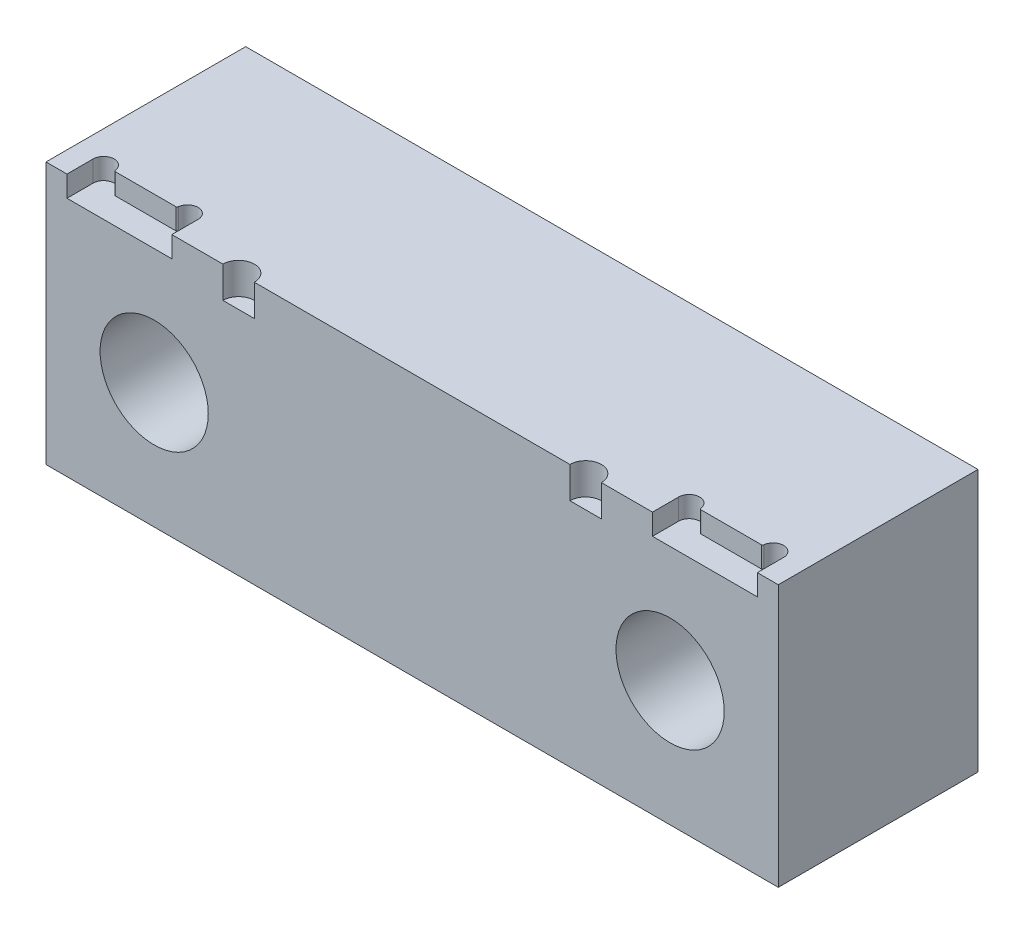
ISO-10303-21;
HEADER;
FILE_DESCRIPTION(('STEP AP214'),'2;1');
FILE_NAME('part.step','',(''),(''),'','','');
FILE_SCHEMA(('AUTOMOTIVE_DESIGN { 1 0 10303 214 1 1 1 1 }'));
ENDSEC;
DATA;
#1=APPLICATION_CONTEXT('core data for automotive mechanical design processes');
#2=APPLICATION_PROTOCOL_DEFINITION('international standard','automotive_design',2000,#1);
#3=PRODUCT_CONTEXT('',#1,'mechanical');
#4=PRODUCT('Part','Part','',(#3));
#5=PRODUCT_RELATED_PRODUCT_CATEGORY('part','',(#4));
#6=PRODUCT_DEFINITION_FORMATION('','',#4);
#7=PRODUCT_DEFINITION_CONTEXT('part definition',#1,'design');
#8=PRODUCT_DEFINITION('design','',#6,#7);
#9=PRODUCT_DEFINITION_SHAPE('','',#8);
#10=(LENGTH_UNIT() NAMED_UNIT(*) SI_UNIT(.MILLI.,.METRE.));
#11=(NAMED_UNIT(*) PLANE_ANGLE_UNIT() SI_UNIT($,.RADIAN.));
#12=(NAMED_UNIT(*) SI_UNIT($,.STERADIAN.) SOLID_ANGLE_UNIT());
#13=UNCERTAINTY_MEASURE_WITH_UNIT(LENGTH_MEASURE(1.E-05),#10,'distance_accuracy_value','');
#14=(GEOMETRIC_REPRESENTATION_CONTEXT(3) GLOBAL_UNCERTAINTY_ASSIGNED_CONTEXT((#13)) GLOBAL_UNIT_ASSIGNED_CONTEXT((#10,
#11,#12)) REPRESENTATION_CONTEXT('',''));
#15=CARTESIAN_POINT('',(0.,0.,0.));
#16=DIRECTION('',(0.,0.,1.));
#17=DIRECTION('',(1.,0.,0.));
#18=AXIS2_PLACEMENT_3D('',#15,#16,#17);
#19=CARTESIAN_POINT('',(69.85,-25.,-19.05));
#20=DIRECTION('',(0.,0.,1.));
#21=DIRECTION('',(1.,0.,0.));
#22=AXIS2_PLACEMENT_3D('',#19,#20,#21);
#23=PLANE('',#22);
#24=CARTESIAN_POINT('',(-49.2125,-1.124,-19.05));
#25=DIRECTION('',(0.,0.,1.));
#26=DIRECTION('',(1.,0.,0.));
#27=AXIS2_PLACEMENT_3D('',#24,#25,#26);
#28=CIRCLE('',#27,6.94562999999999);
#29=CARTESIAN_POINT('',(-42.26687,-1.124,-19.05));
#30=VERTEX_POINT('',#29);
#31=EDGE_CURVE('E332',#30,#30,#28,.T.);
#32=ORIENTED_EDGE('',*,*,#31,.T.);
#33=EDGE_LOOP('',(#32));
#34=FACE_BOUND('',#33,.T.);
#35=CARTESIAN_POINT('',(49.2125,-1.124,-19.05));
#36=DIRECTION('',(0.,0.,1.));
#37=DIRECTION('',(1.,0.,0.));
#38=AXIS2_PLACEMENT_3D('',#35,#36,#37);
#39=CIRCLE('',#38,6.94562999999999);
#40=CARTESIAN_POINT('',(56.15813,-1.124,-19.05));
#41=VERTEX_POINT('',#40);
#42=EDGE_CURVE('E344',#41,#41,#39,.T.);
#43=ORIENTED_EDGE('',*,*,#42,.T.);
#44=EDGE_LOOP('',(#43));
#45=FACE_BOUND('',#44,.T.);
#46=DIRECTION('',(0.,1.,0.));
#47=VECTOR('',#46,1.);
#48=CARTESIAN_POINT('',(-69.85,-25.,-19.05));
#49=LINE('',#48,#47);
#50=CARTESIAN_POINT('',(-69.85,-25.,-19.05));
#51=VERTEX_POINT('',#50);
#52=CARTESIAN_POINT('',(-69.85,25.,-19.05));
#53=VERTEX_POINT('',#52);
#54=EDGE_CURVE('E347',#51,#53,#49,.T.);
#55=ORIENTED_EDGE('',*,*,#54,.T.);
#56=DIRECTION('',(-1.,0.,0.));
#57=VECTOR('',#56,1.);
#58=CARTESIAN_POINT('',(69.85,25.,-19.05));
#59=LINE('',#58,#57);
#60=CARTESIAN_POINT('',(69.85,25.,-19.05));
#61=VERTEX_POINT('',#60);
#62=EDGE_CURVE('E374',#61,#53,#59,.T.);
#63=ORIENTED_EDGE('',*,*,#62,.F.);
#64=DIRECTION('',(0.,1.,0.));
#65=VECTOR('',#64,1.);
#66=CARTESIAN_POINT('',(69.85,-25.,-19.05));
#67=LINE('',#66,#65);
#68=CARTESIAN_POINT('',(69.85,-25.,-19.05));
#69=VERTEX_POINT('',#68);
#70=EDGE_CURVE('E348',#69,#61,#67,.T.);
#71=ORIENTED_EDGE('',*,*,#70,.F.);
#72=DIRECTION('',(-1.,0.,0.));
#73=VECTOR('',#72,1.);
#74=CARTESIAN_POINT('',(69.85,-25.,-19.05));
#75=LINE('',#74,#73);
#76=EDGE_CURVE('E358',#69,#51,#75,.T.);
#77=ORIENTED_EDGE('',*,*,#76,.T.);
#78=EDGE_LOOP('',(#55,#63,#71,#77));
#79=FACE_BOUND('',#78,.T.);
#80=ADVANCED_FACE('F37',(#34,#45,#79),#23,.F.);
#81=CARTESIAN_POINT('',(69.85,25.,19.05));
#82=DIRECTION('',(0.,-1.,0.));
#83=DIRECTION('',(0.,0.,-1.));
#84=AXIS2_PLACEMENT_3D('',#81,#82,#83);
#85=PLANE('',#84);
#86=CARTESIAN_POINT('',(-63.85,25.,14.05));
#87=DIRECTION('',(0.,-1.,0.));
#88=DIRECTION('',(0.,0.,-1.));
#89=AXIS2_PLACEMENT_3D('',#86,#87,#88);
#90=CIRCLE('',#89,2.);
#91=CARTESIAN_POINT('',(-65.85,25.,14.05));
#92=VERTEX_POINT('',#91);
#93=CARTESIAN_POINT('',(-61.8627392824604,25.,13.8246228926353));
#94=VERTEX_POINT('',#93);
#95=EDGE_CURVE('E215',#92,#94,#90,.T.);
#96=ORIENTED_EDGE('',*,*,#95,.T.);
#97=CARTESIAN_POINT('',(-61.6103571713329,25.,13.796));
#98=DIRECTION('',(0.,-1.,0.));
#99=DIRECTION('',(0.,0.,-1.));
#100=AXIS2_PLACEMENT_3D('',#97,#98,#99);
#101=CIRCLE('',#100,0.254);
#102=CARTESIAN_POINT('',(-61.6103571713329,25.,14.05));
#103=VERTEX_POINT('',#102);
#104=EDGE_CURVE('E386',#94,#103,#101,.F.);
#105=ORIENTED_EDGE('',*,*,#104,.T.);
#106=DIRECTION('',(1.,0.,0.));
#107=VECTOR('',#106,1.);
#108=CARTESIAN_POINT('',(-61.85,25.,14.05));
#109=LINE('',#108,#107);
#110=CARTESIAN_POINT('',(-50.0896428286671,25.,14.05));
#111=VERTEX_POINT('',#110);
#112=EDGE_CURVE('E221',#103,#111,#109,.T.);
#113=ORIENTED_EDGE('',*,*,#112,.T.);
#114=CARTESIAN_POINT('',(-50.0896428286671,25.,13.796));
#115=DIRECTION('',(0.,-1.,0.));
#116=DIRECTION('',(0.,0.,-1.));
#117=AXIS2_PLACEMENT_3D('',#114,#115,#116);
#118=CIRCLE('',#117,0.254);
#119=CARTESIAN_POINT('',(-49.8372607175396,25.,13.8246228926353));
#120=VERTEX_POINT('',#119);
#121=EDGE_CURVE('E384',#111,#120,#118,.F.);
#122=ORIENTED_EDGE('',*,*,#121,.T.);
#123=CARTESIAN_POINT('',(-47.85,25.,14.05));
#124=DIRECTION('',(0.,1.,0.));
#125=DIRECTION('',(0.,0.,1.));
#126=AXIS2_PLACEMENT_3D('',#123,#124,#125);
#127=CIRCLE('',#126,2.00000000000001);
#128=CARTESIAN_POINT('',(-45.85,25.,14.05));
#129=VERTEX_POINT('',#128);
#130=EDGE_CURVE('E231',#129,#120,#127,.T.);
#131=ORIENTED_EDGE('',*,*,#130,.F.);
#132=DIRECTION('',(0.,0.,-1.));
#133=VECTOR('',#132,1.);
#134=CARTESIAN_POINT('',(-45.85,25.,19.05));
#135=LINE('',#134,#133);
#136=CARTESIAN_POINT('',(-45.85,25.,19.05));
#137=VERTEX_POINT('',#136);
#138=EDGE_CURVE('E227',#137,#129,#135,.T.);
#139=ORIENTED_EDGE('',*,*,#138,.F.);
#140=DIRECTION('',(-1.,0.,0.));
#141=VECTOR('',#140,1.);
#142=CARTESIAN_POINT('',(69.85,25.,19.05));
#143=LINE('',#142,#141);
#144=CARTESIAN_POINT('',(-36.1,25.,19.05));
#145=VERTEX_POINT('',#144);
#146=EDGE_CURVE('E376',#145,#137,#143,.T.);
#147=ORIENTED_EDGE('',*,*,#146,.F.);
#148=CARTESIAN_POINT('',(-33.1,25.,19.05));
#149=DIRECTION('',(0.,1.,0.));
#150=DIRECTION('',(0.,0.,-1.));
#151=AXIS2_PLACEMENT_3D('',#148,#149,#150);
#152=CIRCLE('',#151,3.);
#153=CARTESIAN_POINT('',(-30.1,25.,19.05));
#154=VERTEX_POINT('',#153);
#155=EDGE_CURVE('E307',#154,#145,#152,.T.);
#156=ORIENTED_EDGE('',*,*,#155,.F.);
#157=CARTESIAN_POINT('',(30.1,25.,19.05));
#158=VERTEX_POINT('',#157);
#159=EDGE_CURVE('E764',#158,#154,#143,.T.);
#160=ORIENTED_EDGE('',*,*,#159,.F.);
#161=CARTESIAN_POINT('',(33.1,25.,19.05));
#162=DIRECTION('',(0.,1.,0.));
#163=DIRECTION('',(0.,0.,1.));
#164=AXIS2_PLACEMENT_3D('',#161,#162,#163);
#165=CIRCLE('',#164,3.);
#166=CARTESIAN_POINT('',(36.1,25.,19.05));
#167=VERTEX_POINT('',#166);
#168=EDGE_CURVE('E289',#167,#158,#165,.T.);
#169=ORIENTED_EDGE('',*,*,#168,.F.);
#170=CARTESIAN_POINT('',(45.85,25.,19.05));
#171=VERTEX_POINT('',#170);
#172=EDGE_CURVE('E375',#171,#167,#143,.T.);
#173=ORIENTED_EDGE('',*,*,#172,.F.);
#174=DIRECTION('',(0.,0.,-1.));
#175=VECTOR('',#174,1.);
#176=CARTESIAN_POINT('',(45.85,25.,0.));
#177=LINE('',#176,#175);
#178=CARTESIAN_POINT('',(45.85,25.,14.05));
#179=VERTEX_POINT('',#178);
#180=EDGE_CURVE('E261',#171,#179,#177,.T.);
#181=ORIENTED_EDGE('',*,*,#180,.T.);
#182=CARTESIAN_POINT('',(47.85,25.,14.05));
#183=DIRECTION('',(0.,1.,0.));
#184=DIRECTION('',(0.,0.,1.));
#185=AXIS2_PLACEMENT_3D('',#182,#183,#184);
#186=CIRCLE('',#185,2.00000000000001);
#187=CARTESIAN_POINT('',(49.8372607175396,25.,13.8246228926353));
#188=VERTEX_POINT('',#187);
#189=EDGE_CURVE('E282',#179,#188,#186,.F.);
#190=ORIENTED_EDGE('',*,*,#189,.T.);
#191=CARTESIAN_POINT('',(50.0896428286671,25.,13.796));
#192=DIRECTION('',(0.,-1.,0.));
#193=DIRECTION('',(0.,0.,-1.));
#194=AXIS2_PLACEMENT_3D('',#191,#192,#193);
#195=CIRCLE('',#194,0.254);
#196=CARTESIAN_POINT('',(50.0896428286671,25.,14.05));
#197=VERTEX_POINT('',#196);
#198=EDGE_CURVE('E382',#188,#197,#195,.F.);
#199=ORIENTED_EDGE('',*,*,#198,.T.);
#200=DIRECTION('',(-1.,0.,0.));
#201=VECTOR('',#200,1.);
#202=CARTESIAN_POINT('',(0.,25.,14.05));
#203=LINE('',#202,#201);
#204=CARTESIAN_POINT('',(61.6103571713329,25.,14.05));
#205=VERTEX_POINT('',#204);
#206=EDGE_CURVE('E280',#205,#197,#203,.T.);
#207=ORIENTED_EDGE('',*,*,#206,.F.);
#208=CARTESIAN_POINT('',(61.6103571713329,25.,13.796));
#209=DIRECTION('',(0.,-1.,0.));
#210=DIRECTION('',(0.,0.,-1.));
#211=AXIS2_PLACEMENT_3D('',#208,#209,#210);
#212=CIRCLE('',#211,0.254);
#213=CARTESIAN_POINT('',(61.8627392824604,25.,13.8246228926353));
#214=VERTEX_POINT('',#213);
#215=EDGE_CURVE('E380',#205,#214,#212,.F.);
#216=ORIENTED_EDGE('',*,*,#215,.T.);
#217=CARTESIAN_POINT('',(63.85,25.,14.05));
#218=DIRECTION('',(0.,1.,0.));
#219=DIRECTION('',(0.,0.,1.));
#220=AXIS2_PLACEMENT_3D('',#217,#218,#219);
#221=CIRCLE('',#220,1.99999999999999);
#222=CARTESIAN_POINT('',(65.85,25.,14.0499999999999));
#223=VERTEX_POINT('',#222);
#224=EDGE_CURVE('E278',#223,#214,#221,.T.);
#225=ORIENTED_EDGE('',*,*,#224,.F.);
#226=DIRECTION('',(0.,0.,-1.));
#227=VECTOR('',#226,1.);
#228=CARTESIAN_POINT('',(65.85,25.,0.));
#229=LINE('',#228,#227);
#230=CARTESIAN_POINT('',(65.85,25.,19.05));
#231=VERTEX_POINT('',#230);
#232=EDGE_CURVE('E220',#231,#223,#229,.T.);
#233=ORIENTED_EDGE('',*,*,#232,.F.);
#234=CARTESIAN_POINT('',(69.85,25.,19.05));
#235=VERTEX_POINT('',#234);
#236=EDGE_CURVE('E371',#235,#231,#143,.T.);
#237=ORIENTED_EDGE('',*,*,#236,.F.);
#238=DIRECTION('',(0.,0.,1.));
#239=VECTOR('',#238,1.);
#240=CARTESIAN_POINT('',(69.85,25.,19.05));
#241=LINE('',#240,#239);
#242=EDGE_CURVE('E351',#61,#235,#241,.T.);
#243=ORIENTED_EDGE('',*,*,#242,.F.);
#244=ORIENTED_EDGE('',*,*,#62,.T.);
#245=DIRECTION('',(0.,0.,1.));
#246=VECTOR('',#245,1.);
#247=CARTESIAN_POINT('',(-69.85,25.,19.05));
#248=LINE('',#247,#246);
#249=CARTESIAN_POINT('',(-69.85,25.,19.05));
#250=VERTEX_POINT('',#249);
#251=EDGE_CURVE('E361',#53,#250,#248,.T.);
#252=ORIENTED_EDGE('',*,*,#251,.T.);
#253=CARTESIAN_POINT('',(-65.85,25.,19.05));
#254=VERTEX_POINT('',#253);
#255=EDGE_CURVE('E226',#254,#250,#143,.T.);
#256=ORIENTED_EDGE('',*,*,#255,.F.);
#257=DIRECTION('',(0.,0.,-1.));
#258=VECTOR('',#257,1.);
#259=CARTESIAN_POINT('',(-65.85,25.,19.05));
#260=LINE('',#259,#258);
#261=EDGE_CURVE('E205',#254,#92,#260,.T.);
#262=ORIENTED_EDGE('',*,*,#261,.T.);
#263=EDGE_LOOP('',(#96,#105,#113,#122,#131,#139,#147,#156,#160,#169,#173,#181,#190,#199,#207,
#216,#225,#233,#237,#243,#244,#252,#256,#262));
#264=FACE_BOUND('',#263,.T.);
#265=ADVANCED_FACE('F224',(#264),#85,.F.);
#266=CARTESIAN_POINT('',(69.85,-25.,19.05));
#267=DIRECTION('',(0.,0.,-1.));
#268=DIRECTION('',(-1.,0.,0.));
#269=AXIS2_PLACEMENT_3D('',#266,#267,#268);
#270=PLANE('',#269);
#271=CARTESIAN_POINT('',(-49.2125,-1.124,19.05));
#272=DIRECTION('',(0.,0.,1.));
#273=DIRECTION('',(1.,0.,0.));
#274=AXIS2_PLACEMENT_3D('',#271,#272,#273);
#275=CIRCLE('',#274,10.31875);
#276=CARTESIAN_POINT('',(-38.89375,-1.124,19.05));
#277=VERTEX_POINT('',#276);
#278=EDGE_CURVE('E321',#277,#277,#275,.T.);
#279=ORIENTED_EDGE('',*,*,#278,.F.);
#280=EDGE_LOOP('',(#279));
#281=FACE_BOUND('',#280,.T.);
#282=CARTESIAN_POINT('',(49.2125,-1.124,19.05));
#283=DIRECTION('',(0.,0.,1.));
#284=DIRECTION('',(1.,0.,0.));
#285=AXIS2_PLACEMENT_3D('',#282,#283,#284);
#286=CIRCLE('',#285,10.31875);
#287=CARTESIAN_POINT('',(59.53125,-1.124,19.05));
#288=VERTEX_POINT('',#287);
#289=EDGE_CURVE('E335',#288,#288,#286,.T.);
#290=ORIENTED_EDGE('',*,*,#289,.F.);
#291=EDGE_LOOP('',(#290));
#292=FACE_BOUND('',#291,.T.);
#293=ORIENTED_EDGE('',*,*,#146,.T.);
#294=DIRECTION('',(0.,1.,0.));
#295=VECTOR('',#294,1.);
#296=CARTESIAN_POINT('',(-45.85,21.,19.05));
#297=LINE('',#296,#295);
#298=CARTESIAN_POINT('',(-45.85,21.,19.05));
#299=VERTEX_POINT('',#298);
#300=EDGE_CURVE('E773',#299,#137,#297,.T.);
#301=ORIENTED_EDGE('',*,*,#300,.F.);
#302=DIRECTION('',(1.,0.,0.));
#303=VECTOR('',#302,1.);
#304=CARTESIAN_POINT('',(-65.85,21.,19.05));
#305=LINE('',#304,#303);
#306=CARTESIAN_POINT('',(-65.85,21.,19.05));
#307=VERTEX_POINT('',#306);
#308=EDGE_CURVE('E243',#307,#299,#305,.T.);
#309=ORIENTED_EDGE('',*,*,#308,.F.);
#310=DIRECTION('',(0.,1.,0.));
#311=VECTOR('',#310,1.);
#312=CARTESIAN_POINT('',(-65.85,21.,19.05));
#313=LINE('',#312,#311);
#314=EDGE_CURVE('E211',#307,#254,#313,.T.);
#315=ORIENTED_EDGE('',*,*,#314,.T.);
#316=ORIENTED_EDGE('',*,*,#255,.T.);
#317=DIRECTION('',(0.,-1.,0.));
#318=VECTOR('',#317,1.);
#319=CARTESIAN_POINT('',(-69.85,-25.,19.05));
#320=LINE('',#319,#318);
#321=CARTESIAN_POINT('',(-69.85,-25.,19.05));
#322=VERTEX_POINT('',#321);
#323=EDGE_CURVE('E363',#250,#322,#320,.T.);
#324=ORIENTED_EDGE('',*,*,#323,.T.);
#325=DIRECTION('',(-1.,0.,0.));
#326=VECTOR('',#325,1.);
#327=CARTESIAN_POINT('',(69.85,-25.,19.05));
#328=LINE('',#327,#326);
#329=CARTESIAN_POINT('',(69.85,-25.,19.05));
#330=VERTEX_POINT('',#329);
#331=EDGE_CURVE('E368',#330,#322,#328,.T.);
#332=ORIENTED_EDGE('',*,*,#331,.F.);
#333=DIRECTION('',(0.,-1.,0.));
#334=VECTOR('',#333,1.);
#335=CARTESIAN_POINT('',(69.85,-25.,19.05));
#336=LINE('',#335,#334);
#337=EDGE_CURVE('E354',#235,#330,#336,.T.);
#338=ORIENTED_EDGE('',*,*,#337,.F.);
#339=ORIENTED_EDGE('',*,*,#236,.T.);
#340=DIRECTION('',(0.,1.,0.));
#341=VECTOR('',#340,1.);
#342=CARTESIAN_POINT('',(65.85,21.,19.05));
#343=LINE('',#342,#341);
#344=CARTESIAN_POINT('',(65.85,21.,19.05));
#345=VERTEX_POINT('',#344);
#346=EDGE_CURVE('E287',#345,#231,#343,.T.);
#347=ORIENTED_EDGE('',*,*,#346,.F.);
#348=DIRECTION('',(1.,0.,0.));
#349=VECTOR('',#348,1.);
#350=CARTESIAN_POINT('',(0.,21.,19.05));
#351=LINE('',#350,#349);
#352=CARTESIAN_POINT('',(45.85,21.,19.05));
#353=VERTEX_POINT('',#352);
#354=EDGE_CURVE('E272',#353,#345,#351,.T.);
#355=ORIENTED_EDGE('',*,*,#354,.F.);
#356=DIRECTION('',(0.,1.,0.));
#357=VECTOR('',#356,1.);
#358=CARTESIAN_POINT('',(45.85,21.,19.05));
#359=LINE('',#358,#357);
#360=EDGE_CURVE('E290',#353,#171,#359,.T.);
#361=ORIENTED_EDGE('',*,*,#360,.T.);
#362=ORIENTED_EDGE('',*,*,#172,.T.);
#363=DIRECTION('',(0.,1.,0.));
#364=VECTOR('',#363,1.);
#365=CARTESIAN_POINT('',(36.1,19.,19.05));
#366=LINE('',#365,#364);
#367=CARTESIAN_POINT('',(36.1,19.,19.05));
#368=VERTEX_POINT('',#367);
#369=EDGE_CURVE('E304',#368,#167,#366,.T.);
#370=ORIENTED_EDGE('',*,*,#369,.F.);
#371=DIRECTION('',(1.,0.,0.));
#372=VECTOR('',#371,1.);
#373=CARTESIAN_POINT('',(36.1,19.,19.05));
#374=LINE('',#373,#372);
#375=CARTESIAN_POINT('',(30.1,19.,19.05));
#376=VERTEX_POINT('',#375);
#377=EDGE_CURVE('E299',#376,#368,#374,.T.);
#378=ORIENTED_EDGE('',*,*,#377,.F.);
#379=DIRECTION('',(0.,1.,0.));
#380=VECTOR('',#379,1.);
#381=CARTESIAN_POINT('',(30.1,19.,19.05));
#382=LINE('',#381,#380);
#383=EDGE_CURVE('E302',#376,#158,#382,.T.);
#384=ORIENTED_EDGE('',*,*,#383,.T.);
#385=ORIENTED_EDGE('',*,*,#159,.T.);
#386=DIRECTION('',(0.,1.,0.));
#387=VECTOR('',#386,1.);
#388=CARTESIAN_POINT('',(-30.1,19.,19.05));
#389=LINE('',#388,#387);
#390=CARTESIAN_POINT('',(-30.1,19.,19.05));
#391=VERTEX_POINT('',#390);
#392=EDGE_CURVE('E318',#391,#154,#389,.T.);
#393=ORIENTED_EDGE('',*,*,#392,.F.);
#394=DIRECTION('',(1.,0.,0.));
#395=VECTOR('',#394,1.);
#396=CARTESIAN_POINT('',(-36.1,19.,19.05));
#397=LINE('',#396,#395);
#398=CARTESIAN_POINT('',(-36.1,19.,19.05));
#399=VERTEX_POINT('',#398);
#400=EDGE_CURVE('E313',#399,#391,#397,.T.);
#401=ORIENTED_EDGE('',*,*,#400,.F.);
#402=DIRECTION('',(0.,1.,0.));
#403=VECTOR('',#402,1.);
#404=CARTESIAN_POINT('',(-36.1,19.,19.05));
#405=LINE('',#404,#403);
#406=EDGE_CURVE('E316',#399,#145,#405,.T.);
#407=ORIENTED_EDGE('',*,*,#406,.T.);
#408=EDGE_LOOP('',(#293,#301,#309,#315,#316,#324,#332,#338,#339,#347,#355,#361,#362,#370,#378,
#384,#385,#393,#401,#407));
#409=FACE_BOUND('',#408,.T.);
#410=ADVANCED_FACE('F432',(#281,#292,#409),#270,.F.);
#411=CARTESIAN_POINT('',(69.85,-25.,19.05));
#412=DIRECTION('',(0.,1.,0.));
#413=DIRECTION('',(0.,0.,1.));
#414=AXIS2_PLACEMENT_3D('',#411,#412,#413);
#415=PLANE('',#414);
#416=DIRECTION('',(0.,0.,-1.));
#417=VECTOR('',#416,1.);
#418=CARTESIAN_POINT('',(-69.85,-25.,19.05));
#419=LINE('',#418,#417);
#420=EDGE_CURVE('E352',#322,#51,#419,.T.);
#421=ORIENTED_EDGE('',*,*,#420,.T.);
#422=ORIENTED_EDGE('',*,*,#76,.F.);
#423=DIRECTION('',(0.,0.,-1.));
#424=VECTOR('',#423,1.);
#425=CARTESIAN_POINT('',(69.85,-25.,19.05));
#426=LINE('',#425,#424);
#427=EDGE_CURVE('E356',#330,#69,#426,.T.);
#428=ORIENTED_EDGE('',*,*,#427,.F.);
#429=ORIENTED_EDGE('',*,*,#331,.T.);
#430=EDGE_LOOP('',(#421,#422,#428,#429));
#431=FACE_BOUND('',#430,.T.);
#432=ADVANCED_FACE('F448',(#431),#415,.F.);
#433=CARTESIAN_POINT('',(69.85,0.,0.));
#434=DIRECTION('',(-1.,0.,0.));
#435=DIRECTION('',(0.,0.,1.));
#436=AXIS2_PLACEMENT_3D('',#433,#434,#435);
#437=PLANE('',#436);
#438=ORIENTED_EDGE('',*,*,#70,.T.);
#439=ORIENTED_EDGE('',*,*,#242,.T.);
#440=ORIENTED_EDGE('',*,*,#337,.T.);
#441=ORIENTED_EDGE('',*,*,#427,.T.);
#442=EDGE_LOOP('',(#438,#439,#440,#441));
#443=FACE_BOUND('',#442,.T.);
#444=ADVANCED_FACE('F437',(#443),#437,.F.);
#445=CARTESIAN_POINT('',(-69.85,0.,0.));
#446=DIRECTION('',(-1.,0.,0.));
#447=DIRECTION('',(0.,0.,1.));
#448=AXIS2_PLACEMENT_3D('',#445,#446,#447);
#449=PLANE('',#448);
#450=ORIENTED_EDGE('',*,*,#54,.F.);
#451=ORIENTED_EDGE('',*,*,#420,.F.);
#452=ORIENTED_EDGE('',*,*,#323,.F.);
#453=ORIENTED_EDGE('',*,*,#251,.F.);
#454=EDGE_LOOP('',(#450,#451,#452,#453));
#455=FACE_BOUND('',#454,.T.);
#456=ADVANCED_FACE('F446',(#455),#449,.T.);
#457=CARTESIAN_POINT('',(49.2125,-1.124,19.05));
#458=DIRECTION('',(0.,0.,1.));
#459=DIRECTION('',(1.,0.,0.));
#460=AXIS2_PLACEMENT_3D('',#457,#458,#459);
#461=CYLINDRICAL_SURFACE('',#460,6.94562999999999);
#462=ORIENTED_EDGE('',*,*,#42,.F.);
#463=EDGE_LOOP('',(#462));
#464=FACE_BOUND('',#463,.T.);
#465=CARTESIAN_POINT('',(49.2125,-1.124,-8.89));
#466=DIRECTION('',(0.,0.,1.));
#467=DIRECTION('',(1.,0.,0.));
#468=AXIS2_PLACEMENT_3D('',#465,#466,#467);
#469=CIRCLE('',#468,6.94562999999999);
#470=CARTESIAN_POINT('',(56.15813,-1.124,-8.89));
#471=VERTEX_POINT('',#470);
#472=EDGE_CURVE('E341',#471,#471,#469,.T.);
#473=ORIENTED_EDGE('',*,*,#472,.T.);
#474=EDGE_LOOP('',(#473));
#475=FACE_BOUND('',#474,.T.);
#476=ADVANCED_FACE('F707',(#464,#475),#461,.F.);
#477=CARTESIAN_POINT('',(56.15813,-1.124,-8.89));
#478=DIRECTION('',(0.,0.,-1.));
#479=DIRECTION('',(-1.,0.,0.));
#480=AXIS2_PLACEMENT_3D('',#477,#478,#479);
#481=PLANE('',#480);
#482=ORIENTED_EDGE('',*,*,#472,.F.);
#483=EDGE_LOOP('',(#482));
#484=FACE_BOUND('',#483,.T.);
#485=CARTESIAN_POINT('',(49.2125,-1.124,-8.89));
#486=DIRECTION('',(0.,0.,1.));
#487=DIRECTION('',(1.,0.,0.));
#488=AXIS2_PLACEMENT_3D('',#485,#486,#487);
#489=CIRCLE('',#488,10.31875);
#490=CARTESIAN_POINT('',(59.53125,-1.124,-8.89));
#491=VERTEX_POINT('',#490);
#492=EDGE_CURVE('E338',#491,#491,#489,.T.);
#493=ORIENTED_EDGE('',*,*,#492,.T.);
#494=EDGE_LOOP('',(#493));
#495=FACE_BOUND('',#494,.T.);
#496=ADVANCED_FACE('F697',(#484,#495),#481,.F.);
#497=CARTESIAN_POINT('',(49.2125,-1.124,19.05));
#498=DIRECTION('',(0.,0.,1.));
#499=DIRECTION('',(1.,0.,0.));
#500=AXIS2_PLACEMENT_3D('',#497,#498,#499);
#501=CYLINDRICAL_SURFACE('',#500,10.31875);
#502=ORIENTED_EDGE('',*,*,#492,.F.);
#503=EDGE_LOOP('',(#502));
#504=FACE_BOUND('',#503,.T.);
#505=ORIENTED_EDGE('',*,*,#289,.T.);
#506=EDGE_LOOP('',(#505));
#507=FACE_BOUND('',#506,.T.);
#508=ADVANCED_FACE('F687',(#504,#507),#501,.F.);
#509=CARTESIAN_POINT('',(-49.2125,-1.124,19.05));
#510=DIRECTION('',(0.,0.,1.));
#511=DIRECTION('',(1.,0.,0.));
#512=AXIS2_PLACEMENT_3D('',#509,#510,#511);
#513=CYLINDRICAL_SURFACE('',#512,6.94562999999999);
#514=ORIENTED_EDGE('',*,*,#31,.F.);
#515=EDGE_LOOP('',(#514));
#516=FACE_BOUND('',#515,.T.);
#517=CARTESIAN_POINT('',(-49.2125,-1.124,-8.89));
#518=DIRECTION('',(0.,0.,1.));
#519=DIRECTION('',(1.,0.,0.));
#520=AXIS2_PLACEMENT_3D('',#517,#518,#519);
#521=CIRCLE('',#520,6.94562999999999);
#522=CARTESIAN_POINT('',(-42.26687,-1.124,-8.89));
#523=VERTEX_POINT('',#522);
#524=EDGE_CURVE('E329',#523,#523,#521,.T.);
#525=ORIENTED_EDGE('',*,*,#524,.T.);
#526=EDGE_LOOP('',(#525));
#527=FACE_BOUND('',#526,.T.);
#528=ADVANCED_FACE('F677',(#516,#527),#513,.F.);
#529=CARTESIAN_POINT('',(-42.26687,-1.124,-8.89));
#530=DIRECTION('',(0.,0.,-1.));
#531=DIRECTION('',(-1.,0.,0.));
#532=AXIS2_PLACEMENT_3D('',#529,#530,#531);
#533=PLANE('',#532);
#534=ORIENTED_EDGE('',*,*,#524,.F.);
#535=EDGE_LOOP('',(#534));
#536=FACE_BOUND('',#535,.T.);
#537=CARTESIAN_POINT('',(-49.2125,-1.124,-8.89));
#538=DIRECTION('',(0.,0.,1.));
#539=DIRECTION('',(1.,0.,0.));
#540=AXIS2_PLACEMENT_3D('',#537,#538,#539);
#541=CIRCLE('',#540,10.31875);
#542=CARTESIAN_POINT('',(-38.89375,-1.124,-8.89));
#543=VERTEX_POINT('',#542);
#544=EDGE_CURVE('E326',#543,#543,#541,.T.);
#545=ORIENTED_EDGE('',*,*,#544,.T.);
#546=EDGE_LOOP('',(#545));
#547=FACE_BOUND('',#546,.T.);
#548=ADVANCED_FACE('F667',(#536,#547),#533,.F.);
#549=CARTESIAN_POINT('',(-49.2125,-1.124,19.05));
#550=DIRECTION('',(0.,0.,1.));
#551=DIRECTION('',(1.,0.,0.));
#552=AXIS2_PLACEMENT_3D('',#549,#550,#551);
#553=CYLINDRICAL_SURFACE('',#552,10.31875);
#554=ORIENTED_EDGE('',*,*,#544,.F.);
#555=EDGE_LOOP('',(#554));
#556=FACE_BOUND('',#555,.T.);
#557=ORIENTED_EDGE('',*,*,#278,.T.);
#558=EDGE_LOOP('',(#557));
#559=FACE_BOUND('',#558,.T.);
#560=ADVANCED_FACE('F657',(#556,#559),#553,.F.);
#561=CARTESIAN_POINT('',(-33.1,19.,19.05));
#562=DIRECTION('',(0.,1.,0.));
#563=DIRECTION('',(0.,0.,1.));
#564=AXIS2_PLACEMENT_3D('',#561,#562,#563);
#565=CYLINDRICAL_SURFACE('',#564,3.);
#566=ORIENTED_EDGE('',*,*,#155,.T.);
#567=ORIENTED_EDGE('',*,*,#406,.F.);
#568=CARTESIAN_POINT('',(-33.1,19.,19.05));
#569=DIRECTION('',(0.,1.,0.));
#570=DIRECTION('',(0.,0.,-1.));
#571=AXIS2_PLACEMENT_3D('',#568,#569,#570);
#572=CIRCLE('',#571,3.);
#573=EDGE_CURVE('E310',#391,#399,#572,.T.);
#574=ORIENTED_EDGE('',*,*,#573,.F.);
#575=ORIENTED_EDGE('',*,*,#392,.T.);
#576=EDGE_LOOP('',(#566,#567,#574,#575));
#577=FACE_BOUND('',#576,.T.);
#578=ADVANCED_FACE('F647',(#577),#565,.F.);
#579=CARTESIAN_POINT('',(-33.1,19.,19.05));
#580=DIRECTION('',(0.,-1.,0.));
#581=DIRECTION('',(0.,0.,-1.));
#582=AXIS2_PLACEMENT_3D('',#579,#580,#581);
#583=PLANE('',#582);
#584=ORIENTED_EDGE('',*,*,#573,.T.);
#585=ORIENTED_EDGE('',*,*,#400,.T.);
#586=EDGE_LOOP('',(#584,#585));
#587=FACE_BOUND('',#586,.T.);
#588=ADVANCED_FACE('F637',(#587),#583,.F.);
#589=CARTESIAN_POINT('',(33.1,19.,19.05));
#590=DIRECTION('',(0.,1.,0.));
#591=DIRECTION('',(0.,0.,1.));
#592=AXIS2_PLACEMENT_3D('',#589,#590,#591);
#593=CYLINDRICAL_SURFACE('',#592,3.);
#594=ORIENTED_EDGE('',*,*,#168,.T.);
#595=ORIENTED_EDGE('',*,*,#383,.F.);
#596=CARTESIAN_POINT('',(33.1,19.,19.05));
#597=DIRECTION('',(0.,1.,0.));
#598=DIRECTION('',(0.,0.,1.));
#599=AXIS2_PLACEMENT_3D('',#596,#597,#598);
#600=CIRCLE('',#599,3.);
#601=EDGE_CURVE('E296',#368,#376,#600,.T.);
#602=ORIENTED_EDGE('',*,*,#601,.F.);
#603=ORIENTED_EDGE('',*,*,#369,.T.);
#604=EDGE_LOOP('',(#594,#595,#602,#603));
#605=FACE_BOUND('',#604,.T.);
#606=ADVANCED_FACE('F627',(#605),#593,.F.);
#607=CARTESIAN_POINT('',(33.1,19.,19.05));
#608=DIRECTION('',(0.,1.,0.));
#609=DIRECTION('',(0.,0.,1.));
#610=AXIS2_PLACEMENT_3D('',#607,#608,#609);
#611=PLANE('',#610);
#612=ORIENTED_EDGE('',*,*,#601,.T.);
#613=ORIENTED_EDGE('',*,*,#377,.T.);
#614=EDGE_LOOP('',(#612,#613));
#615=FACE_BOUND('',#614,.T.);
#616=ADVANCED_FACE('F612',(#615),#611,.T.);
#617=CARTESIAN_POINT('',(65.85,21.,0.));
#618=DIRECTION('',(1.,0.,0.));
#619=DIRECTION('',(0.,0.,-1.));
#620=AXIS2_PLACEMENT_3D('',#617,#618,#619);
#621=PLANE('',#620);
#622=ORIENTED_EDGE('',*,*,#232,.T.);
#623=DIRECTION('',(0.,1.,0.));
#624=VECTOR('',#623,1.);
#625=CARTESIAN_POINT('',(65.85,21.,14.0499999999999));
#626=LINE('',#625,#624);
#627=CARTESIAN_POINT('',(65.85,21.,14.0499999999999));
#628=VERTEX_POINT('',#627);
#629=EDGE_CURVE('E275',#628,#223,#626,.T.);
#630=ORIENTED_EDGE('',*,*,#629,.F.);
#631=DIRECTION('',(0.,0.,-1.));
#632=VECTOR('',#631,1.);
#633=CARTESIAN_POINT('',(65.85,21.,0.));
#634=LINE('',#633,#632);
#635=EDGE_CURVE('E256',#345,#628,#634,.T.);
#636=ORIENTED_EDGE('',*,*,#635,.F.);
#637=ORIENTED_EDGE('',*,*,#346,.T.);
#638=EDGE_LOOP('',(#622,#630,#636,#637));
#639=FACE_BOUND('',#638,.T.);
#640=ADVANCED_FACE('F426',(#639),#621,.F.);
#641=CARTESIAN_POINT('',(45.85,21.,0.));
#642=DIRECTION('',(1.,0.,0.));
#643=DIRECTION('',(0.,0.,-1.));
#644=AXIS2_PLACEMENT_3D('',#641,#642,#643);
#645=PLANE('',#644);
#646=ORIENTED_EDGE('',*,*,#180,.F.);
#647=ORIENTED_EDGE('',*,*,#360,.F.);
#648=DIRECTION('',(0.,0.,-1.));
#649=VECTOR('',#648,1.);
#650=CARTESIAN_POINT('',(45.85,21.,0.));
#651=LINE('',#650,#649);
#652=CARTESIAN_POINT('',(45.85,21.,14.05));
#653=VERTEX_POINT('',#652);
#654=EDGE_CURVE('E270',#353,#653,#651,.T.);
#655=ORIENTED_EDGE('',*,*,#654,.T.);
#656=DIRECTION('',(0.,1.,0.));
#657=VECTOR('',#656,1.);
#658=CARTESIAN_POINT('',(45.85,21.,14.05));
#659=LINE('',#658,#657);
#660=EDGE_CURVE('E293',#653,#179,#659,.T.);
#661=ORIENTED_EDGE('',*,*,#660,.T.);
#662=EDGE_LOOP('',(#646,#647,#655,#661));
#663=FACE_BOUND('',#662,.T.);
#664=ADVANCED_FACE('F573',(#663),#645,.T.);
#665=CARTESIAN_POINT('',(47.85,21.,14.05));
#666=DIRECTION('',(0.,1.,0.));
#667=DIRECTION('',(0.,0.,1.));
#668=AXIS2_PLACEMENT_3D('',#665,#666,#667);
#669=CYLINDRICAL_SURFACE('',#668,2.00000000000001);
#670=CARTESIAN_POINT('',(47.85,21.,14.05));
#671=DIRECTION('',(0.,1.,0.));
#672=DIRECTION('',(0.,0.,1.));
#673=AXIS2_PLACEMENT_3D('',#670,#671,#672);
#674=CIRCLE('',#673,2.00000000000001);
#675=CARTESIAN_POINT('',(49.8372607175396,21.,13.8246228926353));
#676=VERTEX_POINT('',#675);
#677=EDGE_CURVE('E266',#653,#676,#674,.F.);
#678=ORIENTED_EDGE('',*,*,#677,.T.);
#679=DIRECTION('',(0.,1.,0.));
#680=VECTOR('',#679,1.);
#681=CARTESIAN_POINT('',(49.8372607175396,21.,13.8246228926353));
#682=LINE('',#681,#680);
#683=EDGE_CURVE('E395',#676,#188,#682,.T.);
#684=ORIENTED_EDGE('',*,*,#683,.T.);
#685=ORIENTED_EDGE('',*,*,#189,.F.);
#686=ORIENTED_EDGE('',*,*,#660,.F.);
#687=EDGE_LOOP('',(#678,#684,#685,#686));
#688=FACE_BOUND('',#687,.T.);
#689=ADVANCED_FACE('F414',(#688),#669,.F.);
#690=CARTESIAN_POINT('',(0.,21.,14.05));
#691=DIRECTION('',(0.,0.,-1.));
#692=DIRECTION('',(-1.,0.,0.));
#693=AXIS2_PLACEMENT_3D('',#690,#691,#692);
#694=PLANE('',#693);
#695=ORIENTED_EDGE('',*,*,#206,.T.);
#696=DIRECTION('',(0.,-1.,0.));
#697=VECTOR('',#696,1.);
#698=CARTESIAN_POINT('',(50.0896428286671,21.,14.05));
#699=LINE('',#698,#697);
#700=CARTESIAN_POINT('',(50.0896428286671,21.,14.05));
#701=VERTEX_POINT('',#700);
#702=EDGE_CURVE('E60',#197,#701,#699,.T.);
#703=ORIENTED_EDGE('',*,*,#702,.T.);
#704=DIRECTION('',(-1.,0.,0.));
#705=VECTOR('',#704,1.);
#706=CARTESIAN_POINT('',(0.,21.,14.05));
#707=LINE('',#706,#705);
#708=CARTESIAN_POINT('',(61.6103571713329,21.,14.05));
#709=VERTEX_POINT('',#708);
#710=EDGE_CURVE('E263',#709,#701,#707,.T.);
#711=ORIENTED_EDGE('',*,*,#710,.F.);
#712=DIRECTION('',(0.,1.,0.));
#713=VECTOR('',#712,1.);
#714=CARTESIAN_POINT('',(61.6103571713329,21.,14.05));
#715=LINE('',#714,#713);
#716=EDGE_CURVE('E398',#709,#205,#715,.T.);
#717=ORIENTED_EDGE('',*,*,#716,.T.);
#718=EDGE_LOOP('',(#695,#703,#711,#717));
#719=FACE_BOUND('',#718,.T.);
#720=ADVANCED_FACE('F418',(#719),#694,.F.);
#721=CARTESIAN_POINT('',(63.85,21.,14.05));
#722=DIRECTION('',(0.,1.,0.));
#723=DIRECTION('',(0.,0.,1.));
#724=AXIS2_PLACEMENT_3D('',#721,#722,#723);
#725=CYLINDRICAL_SURFACE('',#724,1.99999999999999);
#726=ORIENTED_EDGE('',*,*,#224,.T.);
#727=DIRECTION('',(0.,1.,0.));
#728=VECTOR('',#727,1.);
#729=CARTESIAN_POINT('',(61.8627392824604,21.,13.8246228926353));
#730=LINE('',#729,#728);
#731=CARTESIAN_POINT('',(61.8627392824604,21.,13.8246228926353));
#732=VERTEX_POINT('',#731);
#733=EDGE_CURVE('E52',#214,#732,#730,.F.);
#734=ORIENTED_EDGE('',*,*,#733,.T.);
#735=CARTESIAN_POINT('',(63.85,21.,14.05));
#736=DIRECTION('',(0.,1.,0.));
#737=DIRECTION('',(0.,0.,1.));
#738=AXIS2_PLACEMENT_3D('',#735,#736,#737);
#739=CIRCLE('',#738,1.99999999999999);
#740=EDGE_CURVE('E260',#628,#732,#739,.T.);
#741=ORIENTED_EDGE('',*,*,#740,.F.);
#742=ORIENTED_EDGE('',*,*,#629,.T.);
#743=EDGE_LOOP('',(#726,#734,#741,#742));
#744=FACE_BOUND('',#743,.T.);
#745=ADVANCED_FACE('F424',(#744),#725,.F.);
#746=CARTESIAN_POINT('',(0.,21.,0.));
#747=DIRECTION('',(0.,1.,0.));
#748=DIRECTION('',(0.,0.,1.));
#749=AXIS2_PLACEMENT_3D('',#746,#747,#748);
#750=PLANE('',#749);
#751=ORIENTED_EDGE('',*,*,#635,.T.);
#752=ORIENTED_EDGE('',*,*,#740,.T.);
#753=CARTESIAN_POINT('',(61.6103571713329,21.,13.796));
#754=DIRECTION('',(0.,1.,0.));
#755=DIRECTION('',(0.,0.,1.));
#756=AXIS2_PLACEMENT_3D('',#753,#754,#755);
#757=CIRCLE('',#756,0.254);
#758=EDGE_CURVE('E11',#732,#709,#757,.F.);
#759=ORIENTED_EDGE('',*,*,#758,.T.);
#760=ORIENTED_EDGE('',*,*,#710,.T.);
#761=CARTESIAN_POINT('',(50.0896428286671,21.,13.796));
#762=DIRECTION('',(0.,1.,0.));
#763=DIRECTION('',(0.,0.,1.));
#764=AXIS2_PLACEMENT_3D('',#761,#762,#763);
#765=CIRCLE('',#764,0.254);
#766=EDGE_CURVE('E45',#701,#676,#765,.F.);
#767=ORIENTED_EDGE('',*,*,#766,.T.);
#768=ORIENTED_EDGE('',*,*,#677,.F.);
#769=ORIENTED_EDGE('',*,*,#654,.F.);
#770=ORIENTED_EDGE('',*,*,#354,.T.);
#771=EDGE_LOOP('',(#751,#752,#759,#760,#767,#768,#769,#770));
#772=FACE_BOUND('',#771,.T.);
#773=ADVANCED_FACE('F409',(#772),#750,.T.);
#774=CARTESIAN_POINT('',(-63.85,21.,14.05));
#775=DIRECTION('',(0.,1.,0.));
#776=DIRECTION('',(0.,0.,1.));
#777=AXIS2_PLACEMENT_3D('',#774,#775,#776);
#778=CYLINDRICAL_SURFACE('',#777,2.);
#779=CARTESIAN_POINT('',(-63.85,21.,14.05));
#780=DIRECTION('',(0.,-1.,0.));
#781=DIRECTION('',(0.,0.,-1.));
#782=AXIS2_PLACEMENT_3D('',#779,#780,#781);
#783=CIRCLE('',#782,2.);
#784=CARTESIAN_POINT('',(-65.85,21.,14.05));
#785=VERTEX_POINT('',#784);
#786=CARTESIAN_POINT('',(-61.8627392824604,21.,13.8246228926353));
#787=VERTEX_POINT('',#786);
#788=EDGE_CURVE('E228',#785,#787,#783,.T.);
#789=ORIENTED_EDGE('',*,*,#788,.T.);
#790=DIRECTION('',(0.,1.,0.));
#791=VECTOR('',#790,1.);
#792=CARTESIAN_POINT('',(-61.8627392824604,21.,13.8246228926353));
#793=LINE('',#792,#791);
#794=EDGE_CURVE('E218',#787,#94,#793,.T.);
#795=ORIENTED_EDGE('',*,*,#794,.T.);
#796=ORIENTED_EDGE('',*,*,#95,.F.);
#797=DIRECTION('',(0.,1.,0.));
#798=VECTOR('',#797,1.);
#799=CARTESIAN_POINT('',(-65.85,21.,14.05));
#800=LINE('',#799,#798);
#801=EDGE_CURVE('E200',#785,#92,#800,.T.);
#802=ORIENTED_EDGE('',*,*,#801,.F.);
#803=EDGE_LOOP('',(#789,#795,#796,#802));
#804=FACE_BOUND('',#803,.T.);
#805=ADVANCED_FACE('F216',(#804),#778,.F.);
#806=CARTESIAN_POINT('',(-61.85,21.,14.05));
#807=DIRECTION('',(0.,0.,1.));
#808=DIRECTION('',(1.,0.,0.));
#809=AXIS2_PLACEMENT_3D('',#806,#807,#808);
#810=PLANE('',#809);
#811=ORIENTED_EDGE('',*,*,#112,.F.);
#812=DIRECTION('',(0.,1.,0.));
#813=VECTOR('',#812,1.);
#814=CARTESIAN_POINT('',(-61.6103571713329,21.,14.05));
#815=LINE('',#814,#813);
#816=CARTESIAN_POINT('',(-61.6103571713329,21.,14.05));
#817=VERTEX_POINT('',#816);
#818=EDGE_CURVE('E391',#103,#817,#815,.F.);
#819=ORIENTED_EDGE('',*,*,#818,.T.);
#820=DIRECTION('',(1.,0.,0.));
#821=VECTOR('',#820,1.);
#822=CARTESIAN_POINT('',(-61.85,21.,14.05));
#823=LINE('',#822,#821);
#824=CARTESIAN_POINT('',(-50.0896428286671,21.,14.05));
#825=VERTEX_POINT('',#824);
#826=EDGE_CURVE('E234',#817,#825,#823,.T.);
#827=ORIENTED_EDGE('',*,*,#826,.T.);
#828=DIRECTION('',(0.,-1.,0.));
#829=VECTOR('',#828,1.);
#830=CARTESIAN_POINT('',(-50.0896428286671,25.,14.05));
#831=LINE('',#830,#829);
#832=EDGE_CURVE('E388',#825,#111,#831,.F.);
#833=ORIENTED_EDGE('',*,*,#832,.T.);
#834=EDGE_LOOP('',(#811,#819,#827,#833));
#835=FACE_BOUND('',#834,.T.);
#836=ADVANCED_FACE('F520',(#835),#810,.T.);
#837=CARTESIAN_POINT('',(-47.85,21.,14.05));
#838=DIRECTION('',(0.,1.,0.));
#839=DIRECTION('',(0.,0.,1.));
#840=AXIS2_PLACEMENT_3D('',#837,#838,#839);
#841=CYLINDRICAL_SURFACE('',#840,2.00000000000001);
#842=ORIENTED_EDGE('',*,*,#130,.T.);
#843=DIRECTION('',(0.,1.,0.));
#844=VECTOR('',#843,1.);
#845=CARTESIAN_POINT('',(-49.8372607175396,21.,13.8246228926353));
#846=LINE('',#845,#844);
#847=CARTESIAN_POINT('',(-49.8372607175396,21.,13.8246228926353));
#848=VERTEX_POINT('',#847);
#849=EDGE_CURVE('E393',#120,#848,#846,.F.);
#850=ORIENTED_EDGE('',*,*,#849,.T.);
#851=CARTESIAN_POINT('',(-47.85,21.,14.05));
#852=DIRECTION('',(0.,1.,0.));
#853=DIRECTION('',(0.,0.,1.));
#854=AXIS2_PLACEMENT_3D('',#851,#852,#853);
#855=CIRCLE('',#854,2.00000000000001);
#856=CARTESIAN_POINT('',(-45.85,21.,14.05));
#857=VERTEX_POINT('',#856);
#858=EDGE_CURVE('E250',#857,#848,#855,.T.);
#859=ORIENTED_EDGE('',*,*,#858,.F.);
#860=DIRECTION('',(0.,1.,0.));
#861=VECTOR('',#860,1.);
#862=CARTESIAN_POINT('',(-45.85,21.,14.05));
#863=LINE('',#862,#861);
#864=EDGE_CURVE('E771',#857,#129,#863,.T.);
#865=ORIENTED_EDGE('',*,*,#864,.T.);
#866=EDGE_LOOP('',(#842,#850,#859,#865));
#867=FACE_BOUND('',#866,.T.);
#868=ADVANCED_FACE('F514',(#867),#841,.F.);
#869=CARTESIAN_POINT('',(-45.85,21.,19.05));
#870=DIRECTION('',(1.,0.,0.));
#871=DIRECTION('',(0.,0.,-1.));
#872=AXIS2_PLACEMENT_3D('',#869,#870,#871);
#873=PLANE('',#872);
#874=ORIENTED_EDGE('',*,*,#138,.T.);
#875=ORIENTED_EDGE('',*,*,#864,.F.);
#876=DIRECTION('',(0.,0.,-1.));
#877=VECTOR('',#876,1.);
#878=CARTESIAN_POINT('',(-45.85,21.,19.05));
#879=LINE('',#878,#877);
#880=EDGE_CURVE('E246',#299,#857,#879,.T.);
#881=ORIENTED_EDGE('',*,*,#880,.F.);
#882=ORIENTED_EDGE('',*,*,#300,.T.);
#883=EDGE_LOOP('',(#874,#875,#881,#882));
#884=FACE_BOUND('',#883,.T.);
#885=ADVANCED_FACE('F519',(#884),#873,.F.);
#886=CARTESIAN_POINT('',(-65.85,21.,19.05));
#887=DIRECTION('',(1.,0.,0.));
#888=DIRECTION('',(0.,0.,-1.));
#889=AXIS2_PLACEMENT_3D('',#886,#887,#888);
#890=PLANE('',#889);
#891=ORIENTED_EDGE('',*,*,#261,.F.);
#892=ORIENTED_EDGE('',*,*,#314,.F.);
#893=DIRECTION('',(0.,0.,-1.));
#894=VECTOR('',#893,1.);
#895=CARTESIAN_POINT('',(-65.85,21.,19.05));
#896=LINE('',#895,#894);
#897=EDGE_CURVE('E207',#307,#785,#896,.T.);
#898=ORIENTED_EDGE('',*,*,#897,.T.);
#899=ORIENTED_EDGE('',*,*,#801,.T.);
#900=EDGE_LOOP('',(#891,#892,#898,#899));
#901=FACE_BOUND('',#900,.T.);
#902=ADVANCED_FACE('F202',(#901),#890,.T.);
#903=CARTESIAN_POINT('',(-63.85,21.,14.05));
#904=DIRECTION('',(0.,-1.,0.));
#905=DIRECTION('',(0.,0.,-1.));
#906=AXIS2_PLACEMENT_3D('',#903,#904,#905);
#907=PLANE('',#906);
#908=ORIENTED_EDGE('',*,*,#788,.F.);
#909=ORIENTED_EDGE('',*,*,#897,.F.);
#910=ORIENTED_EDGE('',*,*,#308,.T.);
#911=ORIENTED_EDGE('',*,*,#880,.T.);
#912=ORIENTED_EDGE('',*,*,#858,.T.);
#913=CARTESIAN_POINT('',(-50.0896428286671,21.,13.796));
#914=DIRECTION('',(0.,-1.,0.));
#915=DIRECTION('',(0.,0.,-1.));
#916=AXIS2_PLACEMENT_3D('',#913,#914,#915);
#917=CIRCLE('',#916,0.254);
#918=EDGE_CURVE('E405',#848,#825,#917,.T.);
#919=ORIENTED_EDGE('',*,*,#918,.T.);
#920=ORIENTED_EDGE('',*,*,#826,.F.);
#921=CARTESIAN_POINT('',(-61.6103571713329,21.,13.796));
#922=DIRECTION('',(0.,-1.,0.));
#923=DIRECTION('',(0.,0.,-1.));
#924=AXIS2_PLACEMENT_3D('',#921,#922,#923);
#925=CIRCLE('',#924,0.254);
#926=EDGE_CURVE('E403',#817,#787,#925,.T.);
#927=ORIENTED_EDGE('',*,*,#926,.T.);
#928=EDGE_LOOP('',(#908,#909,#910,#911,#912,#919,#920,#927));
#929=FACE_BOUND('',#928,.T.);
#930=ADVANCED_FACE('F472',(#929),#907,.F.);
#931=CARTESIAN_POINT('',(-61.6103571713329,21.,13.796));
#932=DIRECTION('',(0.,1.,0.));
#933=DIRECTION('',(0.,0.,1.));
#934=AXIS2_PLACEMENT_3D('',#931,#932,#933);
#935=CYLINDRICAL_SURFACE('',#934,0.254);
#936=ORIENTED_EDGE('',*,*,#926,.F.);
#937=ORIENTED_EDGE('',*,*,#818,.F.);
#938=ORIENTED_EDGE('',*,*,#104,.F.);
#939=ORIENTED_EDGE('',*,*,#794,.F.);
#940=EDGE_LOOP('',(#936,#937,#938,#939));
#941=FACE_BOUND('',#940,.T.);
#942=ADVANCED_FACE('F468',(#941),#935,.T.);
#943=CARTESIAN_POINT('',(-50.0896428286671,21.,13.796));
#944=DIRECTION('',(0.,1.,0.));
#945=DIRECTION('',(0.,0.,1.));
#946=AXIS2_PLACEMENT_3D('',#943,#944,#945);
#947=CYLINDRICAL_SURFACE('',#946,0.254);
#948=ORIENTED_EDGE('',*,*,#918,.F.);
#949=ORIENTED_EDGE('',*,*,#849,.F.);
#950=ORIENTED_EDGE('',*,*,#121,.F.);
#951=ORIENTED_EDGE('',*,*,#832,.F.);
#952=EDGE_LOOP('',(#948,#949,#950,#951));
#953=FACE_BOUND('',#952,.T.);
#954=ADVANCED_FACE('F471',(#953),#947,.T.);
#955=CARTESIAN_POINT('',(50.0896428286671,21.,13.796));
#956=DIRECTION('',(0.,1.,0.));
#957=DIRECTION('',(0.,0.,1.));
#958=AXIS2_PLACEMENT_3D('',#955,#956,#957);
#959=CYLINDRICAL_SURFACE('',#958,0.254);
#960=ORIENTED_EDGE('',*,*,#766,.F.);
#961=ORIENTED_EDGE('',*,*,#702,.F.);
#962=ORIENTED_EDGE('',*,*,#198,.F.);
#963=ORIENTED_EDGE('',*,*,#683,.F.);
#964=EDGE_LOOP('',(#960,#961,#962,#963));
#965=FACE_BOUND('',#964,.T.);
#966=ADVANCED_FACE('F416',(#965),#959,.T.);
#967=CARTESIAN_POINT('',(61.6103571713329,21.,13.796));
#968=DIRECTION('',(0.,1.,0.));
#969=DIRECTION('',(0.,0.,1.));
#970=AXIS2_PLACEMENT_3D('',#967,#968,#969);
#971=CYLINDRICAL_SURFACE('',#970,0.254);
#972=ORIENTED_EDGE('',*,*,#758,.F.);
#973=ORIENTED_EDGE('',*,*,#733,.F.);
#974=ORIENTED_EDGE('',*,*,#215,.F.);
#975=ORIENTED_EDGE('',*,*,#716,.F.);
#976=EDGE_LOOP('',(#972,#973,#974,#975));
#977=FACE_BOUND('',#976,.T.);
#978=ADVANCED_FACE('F39',(#977),#971,.T.);
#979=CLOSED_SHELL('',(#80,#265,#410,#432,#444,#456,#476,#496,#508,#528,#548,#560,#578,#588,#606,
#616,#640,#664,#689,#720,#745,#773,#805,#836,#868,#885,#902,#930,#942,#954,#966,#978));
#980=MANIFOLD_SOLID_BREP('B2',#979);
#981=ADVANCED_BREP_SHAPE_REPRESENTATION('',(#18,#980),#14);
#982=SHAPE_DEFINITION_REPRESENTATION(#9,#981);
ENDSEC;
END-ISO-10303-21;
